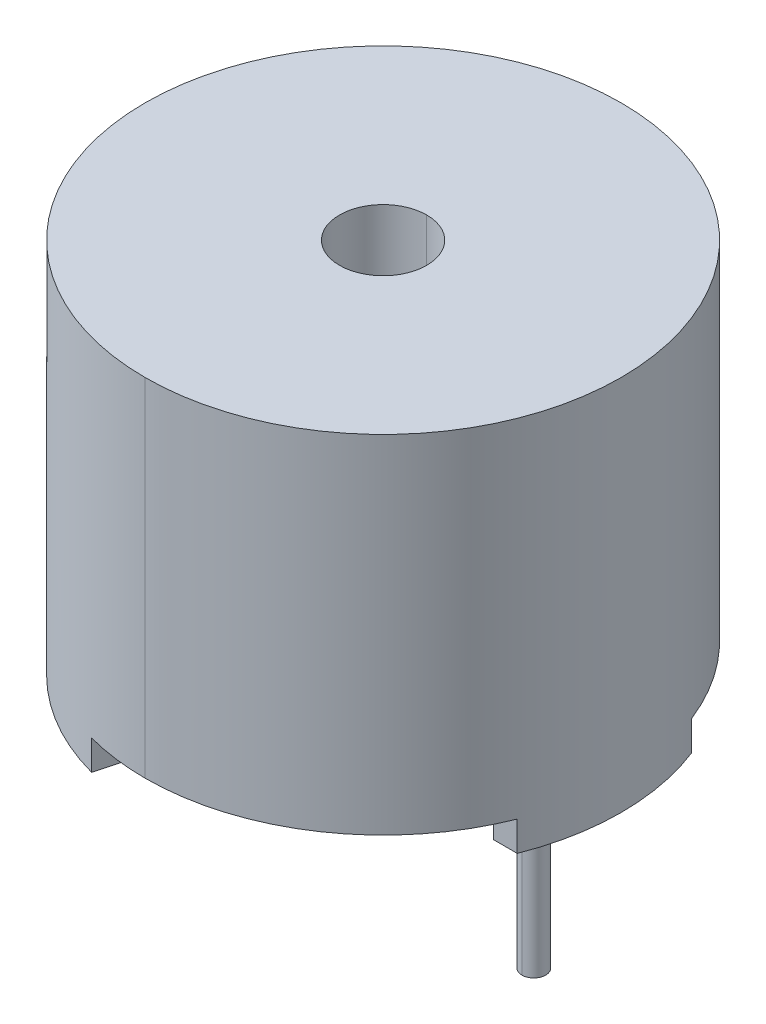
ISO-10303-21;
HEADER;
FILE_DESCRIPTION(('STEP AP214'),'2;1');
FILE_NAME('part.step','',(''),(''),'','','');
FILE_SCHEMA(('AUTOMOTIVE_DESIGN { 1 0 10303 214 1 1 1 1 }'));
ENDSEC;
DATA;
#1=APPLICATION_CONTEXT('core data for automotive mechanical design processes');
#2=APPLICATION_PROTOCOL_DEFINITION('international standard','automotive_design',2000,#1);
#3=PRODUCT_CONTEXT('',#1,'mechanical');
#4=PRODUCT('Part','Part','',(#3));
#5=PRODUCT_RELATED_PRODUCT_CATEGORY('part','',(#4));
#6=PRODUCT_DEFINITION_FORMATION('','',#4);
#7=PRODUCT_DEFINITION_CONTEXT('part definition',#1,'design');
#8=PRODUCT_DEFINITION('design','',#6,#7);
#9=PRODUCT_DEFINITION_SHAPE('','',#8);
#10=(LENGTH_UNIT() NAMED_UNIT(*) SI_UNIT(.MILLI.,.METRE.));
#11=(NAMED_UNIT(*) PLANE_ANGLE_UNIT() SI_UNIT($,.RADIAN.));
#12=(NAMED_UNIT(*) SI_UNIT($,.STERADIAN.) SOLID_ANGLE_UNIT());
#13=UNCERTAINTY_MEASURE_WITH_UNIT(LENGTH_MEASURE(1.E-05),#10,'distance_accuracy_value','');
#14=(GEOMETRIC_REPRESENTATION_CONTEXT(3) GLOBAL_UNCERTAINTY_ASSIGNED_CONTEXT((#13)) GLOBAL_UNIT_ASSIGNED_CONTEXT((#10,
#11,#12)) REPRESENTATION_CONTEXT('',''));
#15=CARTESIAN_POINT('',(0.,0.,0.));
#16=DIRECTION('',(0.,0.,1.));
#17=DIRECTION('',(1.,0.,0.));
#18=AXIS2_PLACEMENT_3D('',#15,#16,#17);
#19=CARTESIAN_POINT('',(-3.8,500000.,0.));
#20=DIRECTION('',(0.,-1.,0.));
#21=DIRECTION('',(0.,0.,-1.));
#22=AXIS2_PLACEMENT_3D('',#19,#20,#21);
#23=CYLINDRICAL_SURFACE('',#22,0.3);
#24=CARTESIAN_POINT('',(-3.8,0.749999999982265,0.));
#25=DIRECTION('',(0.,-1.,0.));
#26=DIRECTION('',(0.,0.,-1.));
#27=AXIS2_PLACEMENT_3D('',#24,#25,#26);
#28=CIRCLE('',#27,0.3);
#29=CARTESIAN_POINT('',(-3.8,0.749999999982265,-0.300000000000001));
#30=VERTEX_POINT('',#29);
#31=CARTESIAN_POINT('',(-3.8,0.749999999982265,0.299999999999999));
#32=VERTEX_POINT('',#31);
#33=EDGE_CURVE('E296',#30,#32,#28,.T.);
#34=ORIENTED_EDGE('',*,*,#33,.T.);
#35=DIRECTION('',(0.,-1.,0.));
#36=VECTOR('',#35,1.);
#37=CARTESIAN_POINT('',(-3.8,500000.,0.299999999999999));
#38=LINE('',#37,#36);
#39=CARTESIAN_POINT('',(-3.8,-3.5,0.299999999999999));
#40=VERTEX_POINT('',#39);
#41=EDGE_CURVE('E288',#32,#40,#38,.T.);
#42=ORIENTED_EDGE('',*,*,#41,.T.);
#43=CARTESIAN_POINT('',(-3.8,-3.5,0.));
#44=DIRECTION('',(0.,-1.,0.));
#45=DIRECTION('',(0.,0.,1.));
#46=AXIS2_PLACEMENT_3D('',#43,#44,#45);
#47=CIRCLE('',#46,0.3);
#48=CARTESIAN_POINT('',(-3.8,-3.5,-0.300000000000001));
#49=VERTEX_POINT('',#48);
#50=EDGE_CURVE('E179',#49,#40,#47,.T.);
#51=ORIENTED_EDGE('',*,*,#50,.F.);
#52=DIRECTION('',(0.,-1.,0.));
#53=VECTOR('',#52,1.);
#54=CARTESIAN_POINT('',(-3.8,500000.,-0.300000000000001));
#55=LINE('',#54,#53);
#56=EDGE_CURVE('E301',#30,#49,#55,.T.);
#57=ORIENTED_EDGE('',*,*,#56,.F.);
#58=EDGE_LOOP('',(#34,#42,#51,#57));
#59=FACE_BOUND('',#58,.T.);
#60=ADVANCED_FACE('F36',(#59),#23,.T.);
#61=CARTESIAN_POINT('',(3.8,500000.,0.));
#62=DIRECTION('',(0.,-1.,0.));
#63=DIRECTION('',(0.,0.,-1.));
#64=AXIS2_PLACEMENT_3D('',#61,#62,#63);
#65=CYLINDRICAL_SURFACE('',#64,0.3);
#66=CARTESIAN_POINT('',(3.8,0.749999999982265,0.));
#67=DIRECTION('',(0.,-1.,0.));
#68=DIRECTION('',(0.,0.,-1.));
#69=AXIS2_PLACEMENT_3D('',#66,#67,#68);
#70=CIRCLE('',#69,0.3);
#71=CARTESIAN_POINT('',(3.8,0.749999999982265,-0.3));
#72=VERTEX_POINT('',#71);
#73=CARTESIAN_POINT('',(3.8,0.749999999982265,0.3));
#74=VERTEX_POINT('',#73);
#75=EDGE_CURVE('E295',#72,#74,#70,.T.);
#76=ORIENTED_EDGE('',*,*,#75,.T.);
#77=DIRECTION('',(0.,-1.,0.));
#78=VECTOR('',#77,1.);
#79=CARTESIAN_POINT('',(3.8,500000.,0.3));
#80=LINE('',#79,#78);
#81=CARTESIAN_POINT('',(3.8,-4.5,0.3));
#82=VERTEX_POINT('',#81);
#83=EDGE_CURVE('E450',#74,#82,#80,.T.);
#84=ORIENTED_EDGE('',*,*,#83,.T.);
#85=CARTESIAN_POINT('',(3.8,-4.5,0.));
#86=DIRECTION('',(0.,-1.,0.));
#87=DIRECTION('',(0.,0.,-1.));
#88=AXIS2_PLACEMENT_3D('',#85,#86,#87);
#89=CIRCLE('',#88,0.3);
#90=CARTESIAN_POINT('',(3.8,-4.5,-0.3));
#91=VERTEX_POINT('',#90);
#92=EDGE_CURVE('E175',#91,#82,#89,.T.);
#93=ORIENTED_EDGE('',*,*,#92,.F.);
#94=DIRECTION('',(0.,-1.,0.));
#95=VECTOR('',#94,1.);
#96=CARTESIAN_POINT('',(3.8,500000.,-0.3));
#97=LINE('',#96,#95);
#98=EDGE_CURVE('E310',#72,#91,#97,.T.);
#99=ORIENTED_EDGE('',*,*,#98,.F.);
#100=EDGE_LOOP('',(#76,#84,#93,#99));
#101=FACE_BOUND('',#100,.T.);
#102=ADVANCED_FACE('F203',(#101),#65,.T.);
#103=CARTESIAN_POINT('',(0.,9.5,0.));
#104=DIRECTION('',(0.,-1.,0.));
#105=DIRECTION('',(0.,0.,-1.));
#106=AXIS2_PLACEMENT_3D('',#103,#104,#105);
#107=CYLINDRICAL_SURFACE('',#106,6.);
#108=CARTESIAN_POINT('',(0.,9.5,0.));
#109=DIRECTION('',(0.,1.,0.));
#110=DIRECTION('',(0.,0.,1.));
#111=AXIS2_PLACEMENT_3D('',#108,#109,#110);
#112=CIRCLE('',#111,6.);
#113=CARTESIAN_POINT('',(0.,9.5,6.));
#114=VERTEX_POINT('',#113);
#115=CARTESIAN_POINT('',(0.,9.5,-6.));
#116=VERTEX_POINT('',#115);
#117=EDGE_CURVE('E346',#114,#116,#112,.T.);
#118=ORIENTED_EDGE('',*,*,#117,.F.);
#119=DIRECTION('',(0.,-1.,0.));
#120=VECTOR('',#119,1.);
#121=CARTESIAN_POINT('',(0.,9.5,6.));
#122=LINE('',#121,#120);
#123=CARTESIAN_POINT('',(0.,0.750000000000001,6.));
#124=VERTEX_POINT('',#123);
#125=EDGE_CURVE('E377',#114,#124,#122,.T.);
#126=ORIENTED_EDGE('',*,*,#125,.T.);
#127=CARTESIAN_POINT('',(0.,0.750000000000001,0.));
#128=DIRECTION('',(0.,-1.,0.));
#129=DIRECTION('',(0.,0.,-1.));
#130=AXIS2_PLACEMENT_3D('',#127,#128,#129);
#131=CIRCLE('',#130,6.);
#132=CARTESIAN_POINT('',(5.58211429478115,0.75,2.2));
#133=VERTEX_POINT('',#132);
#134=EDGE_CURVE('E345',#133,#124,#131,.T.);
#135=ORIENTED_EDGE('',*,*,#134,.F.);
#136=DIRECTION('',(0.,-1.,0.));
#137=VECTOR('',#136,1.);
#138=CARTESIAN_POINT('',(5.58211429478115,0.75,2.2));
#139=LINE('',#138,#137);
#140=CARTESIAN_POINT('',(5.58211429478115,0.,2.2));
#141=VERTEX_POINT('',#140);
#142=EDGE_CURVE('E142',#133,#141,#139,.T.);
#143=ORIENTED_EDGE('',*,*,#142,.T.);
#144=CARTESIAN_POINT('',(0.,0.,0.));
#145=DIRECTION('',(0.,1.,0.));
#146=DIRECTION('',(0.,0.,1.));
#147=AXIS2_PLACEMENT_3D('',#144,#145,#146);
#148=CIRCLE('',#147,6.);
#149=CARTESIAN_POINT('',(5.58211429478115,0.,-2.2));
#150=VERTEX_POINT('',#149);
#151=EDGE_CURVE('E380',#141,#150,#148,.T.);
#152=ORIENTED_EDGE('',*,*,#151,.T.);
#153=DIRECTION('',(0.,-1.,0.));
#154=VECTOR('',#153,1.);
#155=CARTESIAN_POINT('',(5.58211429478115,0.75,-2.2));
#156=LINE('',#155,#154);
#157=CARTESIAN_POINT('',(5.58211429478115,0.75,-2.2));
#158=VERTEX_POINT('',#157);
#159=EDGE_CURVE('E149',#158,#150,#156,.T.);
#160=ORIENTED_EDGE('',*,*,#159,.F.);
#161=CARTESIAN_POINT('',(0.,0.750000000000001,0.));
#162=DIRECTION('',(0.,-1.,0.));
#163=DIRECTION('',(0.,0.,-1.));
#164=AXIS2_PLACEMENT_3D('',#161,#162,#163);
#165=CIRCLE('',#164,6.);
#166=CARTESIAN_POINT('',(0.,0.750000000000001,-6.));
#167=VERTEX_POINT('',#166);
#168=EDGE_CURVE('E132',#167,#158,#165,.T.);
#169=ORIENTED_EDGE('',*,*,#168,.F.);
#170=DIRECTION('',(0.,-1.,0.));
#171=VECTOR('',#170,1.);
#172=CARTESIAN_POINT('',(0.,9.5,-6.));
#173=LINE('',#172,#171);
#174=EDGE_CURVE('E334',#116,#167,#173,.T.);
#175=ORIENTED_EDGE('',*,*,#174,.F.);
#176=EDGE_LOOP('',(#118,#126,#135,#143,#152,#160,#169,#175));
#177=FACE_BOUND('',#176,.T.);
#178=ADVANCED_FACE('F209',(#177),#107,.T.);
#179=CARTESIAN_POINT('',(0.,0.,0.));
#180=DIRECTION('',(0.,1.,0.));
#181=DIRECTION('',(0.,0.,1.));
#182=AXIS2_PLACEMENT_3D('',#179,#180,#181);
#183=PLANE('',#182);
#184=DIRECTION('',(-1.,0.,0.));
#185=VECTOR('',#184,1.);
#186=CARTESIAN_POINT('',(5.58211429478115,0.,2.2));
#187=LINE('',#186,#185);
#188=CARTESIAN_POINT('',(4.98211429478115,0.,2.2));
#189=VERTEX_POINT('',#188);
#190=EDGE_CURVE('E383',#141,#189,#187,.T.);
#191=ORIENTED_EDGE('',*,*,#190,.T.);
#192=CARTESIAN_POINT('',(0.,0.,0.));
#193=DIRECTION('',(0.,1.,0.));
#194=DIRECTION('',(0.,0.,1.));
#195=AXIS2_PLACEMENT_3D('',#192,#193,#194);
#196=CIRCLE('',#195,5.44623382221721);
#197=CARTESIAN_POINT('',(4.98211429478115,0.,-2.2));
#198=VERTEX_POINT('',#197);
#199=EDGE_CURVE('E147',#189,#198,#196,.T.);
#200=ORIENTED_EDGE('',*,*,#199,.T.);
#201=DIRECTION('',(1.,0.,0.));
#202=VECTOR('',#201,1.);
#203=CARTESIAN_POINT('',(5.58211429478115,0.,-2.2));
#204=LINE('',#203,#202);
#205=EDGE_CURVE('E392',#198,#150,#204,.T.);
#206=ORIENTED_EDGE('',*,*,#205,.T.);
#207=ORIENTED_EDGE('',*,*,#151,.F.);
#208=EDGE_LOOP('',(#191,#200,#206,#207));
#209=FACE_BOUND('',#208,.T.);
#210=ADVANCED_FACE('F216',(#209),#183,.F.);
#211=CARTESIAN_POINT('',(0.,0.,0.));
#212=DIRECTION('',(0.,1.,0.));
#213=DIRECTION('',(0.,0.,1.));
#214=AXIS2_PLACEMENT_3D('',#211,#212,#213);
#215=PLANE('',#214);
#216=DIRECTION('',(-0.258819045102525,0.,0.965925826289067));
#217=VECTOR('',#216,1.);
#218=CARTESIAN_POINT('',(-1.55291427061515,0.,5.7955549577344));
#219=LINE('',#218,#217);
#220=CARTESIAN_POINT('',(-1.39762284355364,0.,5.21599946196096));
#221=VERTEX_POINT('',#220);
#222=CARTESIAN_POINT('',(-1.55291427061515,0.,5.7955549577344));
#223=VERTEX_POINT('',#222);
#224=EDGE_CURVE('E362',#221,#223,#219,.T.);
#225=ORIENTED_EDGE('',*,*,#224,.T.);
#226=CARTESIAN_POINT('',(0.,0.,0.));
#227=DIRECTION('',(0.,1.,0.));
#228=DIRECTION('',(0.,0.,1.));
#229=AXIS2_PLACEMENT_3D('',#226,#227,#228);
#230=CIRCLE('',#229,6.);
#231=CARTESIAN_POINT('',(-4.24264068711928,0.,4.24264068711929));
#232=VERTEX_POINT('',#231);
#233=EDGE_CURVE('E357',#232,#223,#230,.T.);
#234=ORIENTED_EDGE('',*,*,#233,.F.);
#235=DIRECTION('',(0.707106781186547,0.,-0.707106781186548));
#236=VECTOR('',#235,1.);
#237=CARTESIAN_POINT('',(-3.81837661840735,0.,3.81837661840736));
#238=LINE('',#237,#236);
#239=CARTESIAN_POINT('',(-3.81837661840735,0.,3.81837661840736));
#240=VERTEX_POINT('',#239);
#241=EDGE_CURVE('E396',#232,#240,#238,.T.);
#242=ORIENTED_EDGE('',*,*,#241,.T.);
#243=CARTESIAN_POINT('',(0.,0.,0.));
#244=DIRECTION('',(0.,1.,0.));
#245=DIRECTION('',(0.,0.,-1.));
#246=AXIS2_PLACEMENT_3D('',#243,#244,#245);
#247=CIRCLE('',#246,5.4);
#248=EDGE_CURVE('E400',#240,#221,#247,.T.);
#249=ORIENTED_EDGE('',*,*,#248,.T.);
#250=EDGE_LOOP('',(#225,#234,#242,#249));
#251=FACE_BOUND('',#250,.T.);
#252=ADVANCED_FACE('F220',(#251),#215,.F.);
#253=CARTESIAN_POINT('',(0.,0.,0.));
#254=DIRECTION('',(0.,1.,0.));
#255=DIRECTION('',(0.,0.,1.));
#256=AXIS2_PLACEMENT_3D('',#253,#254,#255);
#257=PLANE('',#256);
#258=DIRECTION('',(-0.707106781186546,0.,-0.707106781186549));
#259=VECTOR('',#258,1.);
#260=CARTESIAN_POINT('',(-3.81837661840735,0.,-3.81837661840737));
#261=LINE('',#260,#259);
#262=CARTESIAN_POINT('',(-3.81837661840735,0.,-3.81837661840737));
#263=VERTEX_POINT('',#262);
#264=CARTESIAN_POINT('',(-4.24264068711928,0.,-4.24264068711929));
#265=VERTEX_POINT('',#264);
#266=EDGE_CURVE('E73',#263,#265,#261,.T.);
#267=ORIENTED_EDGE('',*,*,#266,.T.);
#268=CARTESIAN_POINT('',(0.,0.,0.));
#269=DIRECTION('',(0.,1.,0.));
#270=DIRECTION('',(0.,0.,1.));
#271=AXIS2_PLACEMENT_3D('',#268,#269,#270);
#272=CIRCLE('',#271,6.);
#273=CARTESIAN_POINT('',(-1.55291427061515,0.,-5.79555495773441));
#274=VERTEX_POINT('',#273);
#275=EDGE_CURVE('E351',#274,#265,#272,.T.);
#276=ORIENTED_EDGE('',*,*,#275,.F.);
#277=DIRECTION('',(0.258819045102525,0.,0.965925826289067));
#278=VECTOR('',#277,1.);
#279=CARTESIAN_POINT('',(-1.55291427061515,0.,-5.79555495773441));
#280=LINE('',#279,#278);
#281=CARTESIAN_POINT('',(-1.39762284355363,0.,-5.21599946196097));
#282=VERTEX_POINT('',#281);
#283=EDGE_CURVE('E335',#274,#282,#280,.T.);
#284=ORIENTED_EDGE('',*,*,#283,.T.);
#285=CARTESIAN_POINT('',(0.,0.,0.));
#286=DIRECTION('',(0.,1.,0.));
#287=DIRECTION('',(0.,0.,1.));
#288=AXIS2_PLACEMENT_3D('',#285,#286,#287);
#289=CIRCLE('',#288,5.4);
#290=EDGE_CURVE('E333',#282,#263,#289,.T.);
#291=ORIENTED_EDGE('',*,*,#290,.T.);
#292=EDGE_LOOP('',(#267,#276,#284,#291));
#293=FACE_BOUND('',#292,.T.);
#294=ADVANCED_FACE('F224',(#293),#257,.F.);
#295=CARTESIAN_POINT('',(0.,9.5,0.));
#296=DIRECTION('',(0.,-1.,0.));
#297=DIRECTION('',(0.,0.,-1.));
#298=AXIS2_PLACEMENT_3D('',#295,#296,#297);
#299=CYLINDRICAL_SURFACE('',#298,6.);
#300=ORIENTED_EDGE('',*,*,#125,.F.);
#301=CARTESIAN_POINT('',(0.,9.5,0.));
#302=DIRECTION('',(0.,1.,0.));
#303=DIRECTION('',(0.,0.,1.));
#304=AXIS2_PLACEMENT_3D('',#301,#302,#303);
#305=CIRCLE('',#304,6.);
#306=EDGE_CURVE('E342',#116,#114,#305,.T.);
#307=ORIENTED_EDGE('',*,*,#306,.F.);
#308=ORIENTED_EDGE('',*,*,#174,.T.);
#309=CARTESIAN_POINT('',(0.,0.750000000000001,0.));
#310=DIRECTION('',(0.,-1.,0.));
#311=DIRECTION('',(0.,0.,-1.));
#312=AXIS2_PLACEMENT_3D('',#309,#310,#311);
#313=CIRCLE('',#312,6.);
#314=CARTESIAN_POINT('',(-1.55291427061515,0.75,-5.79555495773441));
#315=VERTEX_POINT('',#314);
#316=EDGE_CURVE('E347',#315,#167,#313,.T.);
#317=ORIENTED_EDGE('',*,*,#316,.F.);
#318=DIRECTION('',(0.,-1.,0.));
#319=VECTOR('',#318,1.);
#320=CARTESIAN_POINT('',(-1.55291427061515,0.75,-5.79555495773441));
#321=LINE('',#320,#319);
#322=EDGE_CURVE('E330',#315,#274,#321,.T.);
#323=ORIENTED_EDGE('',*,*,#322,.T.);
#324=ORIENTED_EDGE('',*,*,#275,.T.);
#325=DIRECTION('',(0.,-1.,0.));
#326=VECTOR('',#325,1.);
#327=CARTESIAN_POINT('',(-4.24264068711928,0.75,-4.24264068711929));
#328=LINE('',#327,#326);
#329=CARTESIAN_POINT('',(-4.24264068711928,0.75,-4.24264068711929));
#330=VERTEX_POINT('',#329);
#331=EDGE_CURVE('E321',#330,#265,#328,.T.);
#332=ORIENTED_EDGE('',*,*,#331,.F.);
#333=CARTESIAN_POINT('',(0.,0.750000000000001,0.));
#334=DIRECTION('',(0.,-1.,0.));
#335=DIRECTION('',(0.,0.,-1.));
#336=AXIS2_PLACEMENT_3D('',#333,#334,#335);
#337=CIRCLE('',#336,6.);
#338=CARTESIAN_POINT('',(-4.24264068711928,0.75,4.24264068711929));
#339=VERTEX_POINT('',#338);
#340=EDGE_CURVE('E349',#339,#330,#337,.T.);
#341=ORIENTED_EDGE('',*,*,#340,.F.);
#342=DIRECTION('',(0.,-1.,0.));
#343=VECTOR('',#342,1.);
#344=CARTESIAN_POINT('',(-4.24264068711928,0.75,4.24264068711929));
#345=LINE('',#344,#343);
#346=EDGE_CURVE('E355',#339,#232,#345,.T.);
#347=ORIENTED_EDGE('',*,*,#346,.T.);
#348=ORIENTED_EDGE('',*,*,#233,.T.);
#349=DIRECTION('',(0.,-1.,0.));
#350=VECTOR('',#349,1.);
#351=CARTESIAN_POINT('',(-1.55291427061515,0.75,5.7955549577344));
#352=LINE('',#351,#350);
#353=CARTESIAN_POINT('',(-1.55291427061515,0.75,5.7955549577344));
#354=VERTEX_POINT('',#353);
#355=EDGE_CURVE('E314',#354,#223,#352,.T.);
#356=ORIENTED_EDGE('',*,*,#355,.F.);
#357=CARTESIAN_POINT('',(0.,0.750000000000001,0.));
#358=DIRECTION('',(0.,-1.,0.));
#359=DIRECTION('',(0.,0.,-1.));
#360=AXIS2_PLACEMENT_3D('',#357,#358,#359);
#361=CIRCLE('',#360,6.);
#362=EDGE_CURVE('E306',#124,#354,#361,.T.);
#363=ORIENTED_EDGE('',*,*,#362,.F.);
#364=EDGE_LOOP('',(#300,#307,#308,#317,#323,#324,#332,#341,#347,#348,#356,#363));
#365=FACE_BOUND('',#364,.T.);
#366=ADVANCED_FACE('F228',(#365),#299,.T.);
#367=CARTESIAN_POINT('',(0.,9.5,0.));
#368=DIRECTION('',(0.,1.,0.));
#369=DIRECTION('',(0.,0.,1.));
#370=AXIS2_PLACEMENT_3D('',#367,#368,#369);
#371=PLANE('',#370);
#372=ORIENTED_EDGE('',*,*,#306,.T.);
#373=ORIENTED_EDGE('',*,*,#117,.T.);
#374=EDGE_LOOP('',(#372,#373));
#375=FACE_BOUND('',#374,.T.);
#376=CARTESIAN_POINT('',(0.,9.5,0.));
#377=DIRECTION('',(0.,1.,0.));
#378=DIRECTION('',(0.,0.,1.));
#379=AXIS2_PLACEMENT_3D('',#376,#377,#378);
#380=CIRCLE('',#379,1.1);
#381=CARTESIAN_POINT('',(0.,9.5,-1.1));
#382=VERTEX_POINT('',#381);
#383=CARTESIAN_POINT('',(0.,9.5,1.1));
#384=VERTEX_POINT('',#383);
#385=EDGE_CURVE('E65',#382,#384,#380,.T.);
#386=ORIENTED_EDGE('',*,*,#385,.F.);
#387=CARTESIAN_POINT('',(0.,9.5,0.));
#388=DIRECTION('',(0.,1.,0.));
#389=DIRECTION('',(0.,0.,1.));
#390=AXIS2_PLACEMENT_3D('',#387,#388,#389);
#391=CIRCLE('',#390,1.1);
#392=EDGE_CURVE('E11',#384,#382,#391,.T.);
#393=ORIENTED_EDGE('',*,*,#392,.F.);
#394=EDGE_LOOP('',(#386,#393));
#395=FACE_BOUND('',#394,.T.);
#396=ADVANCED_FACE('F232',(#375,#395),#371,.T.);
#397=CARTESIAN_POINT('',(0.274198215040875,0.75,0.));
#398=DIRECTION('',(0.,-1.,0.));
#399=DIRECTION('',(0.,0.,-1.));
#400=AXIS2_PLACEMENT_3D('',#397,#398,#399);
#401=PLANE('',#400);
#402=ORIENTED_EDGE('',*,*,#33,.F.);
#403=CARTESIAN_POINT('',(-3.8,0.749999999982265,0.));
#404=DIRECTION('',(0.,-1.,0.));
#405=DIRECTION('',(0.,0.,-1.));
#406=AXIS2_PLACEMENT_3D('',#403,#404,#405);
#407=CIRCLE('',#406,0.3);
#408=EDGE_CURVE('E174',#32,#30,#407,.T.);
#409=ORIENTED_EDGE('',*,*,#408,.F.);
#410=EDGE_LOOP('',(#402,#409));
#411=FACE_BOUND('',#410,.T.);
#412=ORIENTED_EDGE('',*,*,#75,.F.);
#413=CARTESIAN_POINT('',(3.8,0.749999999982265,0.));
#414=DIRECTION('',(0.,-1.,0.));
#415=DIRECTION('',(0.,0.,-1.));
#416=AXIS2_PLACEMENT_3D('',#413,#414,#415);
#417=CIRCLE('',#416,0.3);
#418=EDGE_CURVE('E170',#74,#72,#417,.T.);
#419=ORIENTED_EDGE('',*,*,#418,.F.);
#420=EDGE_LOOP('',(#412,#419));
#421=FACE_BOUND('',#420,.T.);
#422=ORIENTED_EDGE('',*,*,#134,.T.);
#423=ORIENTED_EDGE('',*,*,#362,.T.);
#424=DIRECTION('',(-0.258819045102525,0.,0.965925826289067));
#425=VECTOR('',#424,1.);
#426=CARTESIAN_POINT('',(-1.55291427061515,0.75,5.7955549577344));
#427=LINE('',#426,#425);
#428=CARTESIAN_POINT('',(-1.39762284355364,0.75,5.21599946196096));
#429=VERTEX_POINT('',#428);
#430=EDGE_CURVE('E311',#429,#354,#427,.T.);
#431=ORIENTED_EDGE('',*,*,#430,.F.);
#432=CARTESIAN_POINT('',(0.,0.75,0.));
#433=DIRECTION('',(0.,1.,0.));
#434=DIRECTION('',(0.,0.,-1.));
#435=AXIS2_PLACEMENT_3D('',#432,#433,#434);
#436=CIRCLE('',#435,5.4);
#437=CARTESIAN_POINT('',(-3.81837661840735,0.75,3.81837661840736));
#438=VERTEX_POINT('',#437);
#439=EDGE_CURVE('E157',#438,#429,#436,.T.);
#440=ORIENTED_EDGE('',*,*,#439,.F.);
#441=DIRECTION('',(0.707106781186547,0.,-0.707106781186548));
#442=VECTOR('',#441,1.);
#443=CARTESIAN_POINT('',(-3.81837661840735,0.75,3.81837661840736));
#444=LINE('',#443,#442);
#445=EDGE_CURVE('E156',#339,#438,#444,.T.);
#446=ORIENTED_EDGE('',*,*,#445,.F.);
#447=ORIENTED_EDGE('',*,*,#340,.T.);
#448=DIRECTION('',(-0.707106781186546,0.,-0.707106781186549));
#449=VECTOR('',#448,1.);
#450=CARTESIAN_POINT('',(-3.81837661840735,0.75,-3.81837661840737));
#451=LINE('',#450,#449);
#452=CARTESIAN_POINT('',(-3.81837661840735,0.75,-3.81837661840737));
#453=VERTEX_POINT('',#452);
#454=EDGE_CURVE('E161',#453,#330,#451,.T.);
#455=ORIENTED_EDGE('',*,*,#454,.F.);
#456=CARTESIAN_POINT('',(0.,0.75,0.));
#457=DIRECTION('',(0.,1.,0.));
#458=DIRECTION('',(0.,0.,1.));
#459=AXIS2_PLACEMENT_3D('',#456,#457,#458);
#460=CIRCLE('',#459,5.4);
#461=CARTESIAN_POINT('',(-1.39762284355363,0.75,-5.21599946196097));
#462=VERTEX_POINT('',#461);
#463=EDGE_CURVE('E166',#462,#453,#460,.T.);
#464=ORIENTED_EDGE('',*,*,#463,.F.);
#465=DIRECTION('',(0.258819045102525,0.,0.965925826289067));
#466=VECTOR('',#465,1.);
#467=CARTESIAN_POINT('',(-1.55291427061515,0.75,-5.79555495773441));
#468=LINE('',#467,#466);
#469=EDGE_CURVE('E165',#315,#462,#468,.T.);
#470=ORIENTED_EDGE('',*,*,#469,.F.);
#471=ORIENTED_EDGE('',*,*,#316,.T.);
#472=ORIENTED_EDGE('',*,*,#168,.T.);
#473=DIRECTION('',(1.,0.,0.));
#474=VECTOR('',#473,1.);
#475=CARTESIAN_POINT('',(5.58211429478115,0.75,-2.2));
#476=LINE('',#475,#474);
#477=CARTESIAN_POINT('',(4.98211429478115,0.75,-2.2));
#478=VERTEX_POINT('',#477);
#479=EDGE_CURVE('E118',#478,#158,#476,.T.);
#480=ORIENTED_EDGE('',*,*,#479,.F.);
#481=CARTESIAN_POINT('',(0.,0.75,0.));
#482=DIRECTION('',(0.,1.,0.));
#483=DIRECTION('',(0.,0.,1.));
#484=AXIS2_PLACEMENT_3D('',#481,#482,#483);
#485=CIRCLE('',#484,5.44623382221721);
#486=CARTESIAN_POINT('',(4.98211429478115,0.75,2.2));
#487=VERTEX_POINT('',#486);
#488=EDGE_CURVE('E121',#487,#478,#485,.T.);
#489=ORIENTED_EDGE('',*,*,#488,.F.);
#490=DIRECTION('',(-1.,0.,0.));
#491=VECTOR('',#490,1.);
#492=CARTESIAN_POINT('',(5.58211429478115,0.75,2.2));
#493=LINE('',#492,#491);
#494=EDGE_CURVE('E126',#133,#487,#493,.T.);
#495=ORIENTED_EDGE('',*,*,#494,.F.);
#496=EDGE_LOOP('',(#422,#423,#431,#440,#446,#447,#455,#464,#470,#471,#472,#480,#489,#495));
#497=FACE_BOUND('',#496,.T.);
#498=ADVANCED_FACE('F124',(#411,#421,#497),#401,.T.);
#499=CARTESIAN_POINT('',(0.,0.75,0.));
#500=DIRECTION('',(0.,-1.,0.));
#501=DIRECTION('',(0.,0.,-1.));
#502=AXIS2_PLACEMENT_3D('',#499,#500,#501);
#503=CYLINDRICAL_SURFACE('',#502,5.44623382221721);
#504=ORIENTED_EDGE('',*,*,#199,.F.);
#505=DIRECTION('',(0.,-1.,0.));
#506=VECTOR('',#505,1.);
#507=CARTESIAN_POINT('',(4.98211429478115,0.75,2.2));
#508=LINE('',#507,#506);
#509=EDGE_CURVE('E140',#487,#189,#508,.T.);
#510=ORIENTED_EDGE('',*,*,#509,.F.);
#511=ORIENTED_EDGE('',*,*,#488,.T.);
#512=DIRECTION('',(0.,-1.,0.));
#513=VECTOR('',#512,1.);
#514=CARTESIAN_POINT('',(4.98211429478115,0.75,-2.2));
#515=LINE('',#514,#513);
#516=EDGE_CURVE('E131',#478,#198,#515,.T.);
#517=ORIENTED_EDGE('',*,*,#516,.T.);
#518=EDGE_LOOP('',(#504,#510,#511,#517));
#519=FACE_BOUND('',#518,.T.);
#520=ADVANCED_FACE('F145',(#519),#503,.F.);
#521=CARTESIAN_POINT('',(5.58211429478115,0.75,2.2));
#522=DIRECTION('',(0.,0.,1.));
#523=DIRECTION('',(1.,0.,0.));
#524=AXIS2_PLACEMENT_3D('',#521,#522,#523);
#525=PLANE('',#524);
#526=ORIENTED_EDGE('',*,*,#190,.F.);
#527=ORIENTED_EDGE('',*,*,#142,.F.);
#528=ORIENTED_EDGE('',*,*,#494,.T.);
#529=ORIENTED_EDGE('',*,*,#509,.T.);
#530=EDGE_LOOP('',(#526,#527,#528,#529));
#531=FACE_BOUND('',#530,.T.);
#532=ADVANCED_FACE('F138',(#531),#525,.T.);
#533=CARTESIAN_POINT('',(5.58211429478115,0.75,-2.2));
#534=DIRECTION('',(0.,0.,-1.));
#535=DIRECTION('',(-1.,0.,0.));
#536=AXIS2_PLACEMENT_3D('',#533,#534,#535);
#537=PLANE('',#536);
#538=ORIENTED_EDGE('',*,*,#205,.F.);
#539=ORIENTED_EDGE('',*,*,#516,.F.);
#540=ORIENTED_EDGE('',*,*,#479,.T.);
#541=ORIENTED_EDGE('',*,*,#159,.T.);
#542=EDGE_LOOP('',(#538,#539,#540,#541));
#543=FACE_BOUND('',#542,.T.);
#544=ADVANCED_FACE('F244',(#543),#537,.T.);
#545=CARTESIAN_POINT('',(-1.55291427061515,0.75,5.79555495773441));
#546=DIRECTION('',(0.965925826289067,0.,0.258819045102525));
#547=DIRECTION('',(0.258819045102525,0.,-0.965925826289067));
#548=AXIS2_PLACEMENT_3D('',#545,#546,#547);
#549=PLANE('',#548);
#550=ORIENTED_EDGE('',*,*,#224,.F.);
#551=DIRECTION('',(0.,-1.,0.));
#552=VECTOR('',#551,1.);
#553=CARTESIAN_POINT('',(-1.39762284355364,0.75,5.21599946196096));
#554=LINE('',#553,#552);
#555=EDGE_CURVE('E153',#429,#221,#554,.T.);
#556=ORIENTED_EDGE('',*,*,#555,.F.);
#557=ORIENTED_EDGE('',*,*,#430,.T.);
#558=ORIENTED_EDGE('',*,*,#355,.T.);
#559=EDGE_LOOP('',(#550,#556,#557,#558));
#560=FACE_BOUND('',#559,.T.);
#561=ADVANCED_FACE('F247',(#560),#549,.T.);
#562=CARTESIAN_POINT('',(0.,0.75,0.));
#563=DIRECTION('',(0.,-1.,0.));
#564=DIRECTION('',(0.,0.,-1.));
#565=AXIS2_PLACEMENT_3D('',#562,#563,#564);
#566=CYLINDRICAL_SURFACE('',#565,5.4);
#567=ORIENTED_EDGE('',*,*,#248,.F.);
#568=DIRECTION('',(0.,-1.,0.));
#569=VECTOR('',#568,1.);
#570=CARTESIAN_POINT('',(-3.81837661840735,0.75,3.81837661840736));
#571=LINE('',#570,#569);
#572=EDGE_CURVE('E158',#438,#240,#571,.T.);
#573=ORIENTED_EDGE('',*,*,#572,.F.);
#574=ORIENTED_EDGE('',*,*,#439,.T.);
#575=ORIENTED_EDGE('',*,*,#555,.T.);
#576=EDGE_LOOP('',(#567,#573,#574,#575));
#577=FACE_BOUND('',#576,.T.);
#578=ADVANCED_FACE('F251',(#577),#566,.F.);
#579=CARTESIAN_POINT('',(-3.81837661840735,0.75,3.81837661840736));
#580=DIRECTION('',(-0.707106781186548,0.,-0.707106781186547));
#581=DIRECTION('',(-0.707106781186547,0.,0.707106781186548));
#582=AXIS2_PLACEMENT_3D('',#579,#580,#581);
#583=PLANE('',#582);
#584=ORIENTED_EDGE('',*,*,#241,.F.);
#585=ORIENTED_EDGE('',*,*,#346,.F.);
#586=ORIENTED_EDGE('',*,*,#445,.T.);
#587=ORIENTED_EDGE('',*,*,#572,.T.);
#588=EDGE_LOOP('',(#584,#585,#586,#587));
#589=FACE_BOUND('',#588,.T.);
#590=ADVANCED_FACE('F255',(#589),#583,.T.);
#591=CARTESIAN_POINT('',(-3.81837661840735,0.75,-3.81837661840737));
#592=DIRECTION('',(-0.707106781186549,0.,0.707106781186546));
#593=DIRECTION('',(0.707106781186546,0.,0.707106781186549));
#594=AXIS2_PLACEMENT_3D('',#591,#592,#593);
#595=PLANE('',#594);
#596=ORIENTED_EDGE('',*,*,#266,.F.);
#597=DIRECTION('',(0.,-1.,0.));
#598=VECTOR('',#597,1.);
#599=CARTESIAN_POINT('',(-3.81837661840735,0.75,-3.81837661840737));
#600=LINE('',#599,#598);
#601=EDGE_CURVE('E162',#453,#263,#600,.T.);
#602=ORIENTED_EDGE('',*,*,#601,.F.);
#603=ORIENTED_EDGE('',*,*,#454,.T.);
#604=ORIENTED_EDGE('',*,*,#331,.T.);
#605=EDGE_LOOP('',(#596,#602,#603,#604));
#606=FACE_BOUND('',#605,.T.);
#607=ADVANCED_FACE('F259',(#606),#595,.T.);
#608=CARTESIAN_POINT('',(0.,0.75,0.));
#609=DIRECTION('',(0.,-1.,0.));
#610=DIRECTION('',(0.,0.,-1.));
#611=AXIS2_PLACEMENT_3D('',#608,#609,#610);
#612=CYLINDRICAL_SURFACE('',#611,5.4);
#613=ORIENTED_EDGE('',*,*,#290,.F.);
#614=DIRECTION('',(0.,-1.,0.));
#615=VECTOR('',#614,1.);
#616=CARTESIAN_POINT('',(-1.39762284355363,0.75,-5.21599946196097));
#617=LINE('',#616,#615);
#618=EDGE_CURVE('E167',#462,#282,#617,.T.);
#619=ORIENTED_EDGE('',*,*,#618,.F.);
#620=ORIENTED_EDGE('',*,*,#463,.T.);
#621=ORIENTED_EDGE('',*,*,#601,.T.);
#622=EDGE_LOOP('',(#613,#619,#620,#621));
#623=FACE_BOUND('',#622,.T.);
#624=ADVANCED_FACE('F263',(#623),#612,.F.);
#625=CARTESIAN_POINT('',(-1.55291427061515,0.75,-5.79555495773441));
#626=DIRECTION('',(0.965925826289067,0.,-0.258819045102525));
#627=DIRECTION('',(-0.258819045102525,0.,-0.965925826289067));
#628=AXIS2_PLACEMENT_3D('',#625,#626,#627);
#629=PLANE('',#628);
#630=ORIENTED_EDGE('',*,*,#283,.F.);
#631=ORIENTED_EDGE('',*,*,#322,.F.);
#632=ORIENTED_EDGE('',*,*,#469,.T.);
#633=ORIENTED_EDGE('',*,*,#618,.T.);
#634=EDGE_LOOP('',(#630,#631,#632,#633));
#635=FACE_BOUND('',#634,.T.);
#636=ADVANCED_FACE('F266',(#635),#629,.T.);
#637=CARTESIAN_POINT('',(3.8,500000.,0.));
#638=DIRECTION('',(0.,-1.,0.));
#639=DIRECTION('',(0.,0.,-1.));
#640=AXIS2_PLACEMENT_3D('',#637,#638,#639);
#641=CYLINDRICAL_SURFACE('',#640,0.3);
#642=ORIENTED_EDGE('',*,*,#83,.F.);
#643=ORIENTED_EDGE('',*,*,#418,.T.);
#644=ORIENTED_EDGE('',*,*,#98,.T.);
#645=CARTESIAN_POINT('',(3.8,-4.5,0.));
#646=DIRECTION('',(0.,-1.,0.));
#647=DIRECTION('',(0.,0.,-1.));
#648=AXIS2_PLACEMENT_3D('',#645,#646,#647);
#649=CIRCLE('',#648,0.3);
#650=EDGE_CURVE('E171',#82,#91,#649,.T.);
#651=ORIENTED_EDGE('',*,*,#650,.F.);
#652=EDGE_LOOP('',(#642,#643,#644,#651));
#653=FACE_BOUND('',#652,.T.);
#654=ADVANCED_FACE('F270',(#653),#641,.T.);
#655=CARTESIAN_POINT('',(3.8,-4.5,0.));
#656=DIRECTION('',(0.,-1.,0.));
#657=DIRECTION('',(0.,0.,-1.));
#658=AXIS2_PLACEMENT_3D('',#655,#656,#657);
#659=PLANE('',#658);
#660=ORIENTED_EDGE('',*,*,#92,.T.);
#661=ORIENTED_EDGE('',*,*,#650,.T.);
#662=EDGE_LOOP('',(#660,#661));
#663=FACE_BOUND('',#662,.T.);
#664=ADVANCED_FACE('F274',(#663),#659,.T.);
#665=CARTESIAN_POINT('',(-3.8,500000.,0.));
#666=DIRECTION('',(0.,-1.,0.));
#667=DIRECTION('',(0.,0.,-1.));
#668=AXIS2_PLACEMENT_3D('',#665,#666,#667);
#669=CYLINDRICAL_SURFACE('',#668,0.3);
#670=ORIENTED_EDGE('',*,*,#41,.F.);
#671=ORIENTED_EDGE('',*,*,#408,.T.);
#672=ORIENTED_EDGE('',*,*,#56,.T.);
#673=CARTESIAN_POINT('',(-3.8,-3.5,0.));
#674=DIRECTION('',(0.,-1.,0.));
#675=DIRECTION('',(0.,0.,1.));
#676=AXIS2_PLACEMENT_3D('',#673,#674,#675);
#677=CIRCLE('',#676,0.3);
#678=EDGE_CURVE('E176',#40,#49,#677,.T.);
#679=ORIENTED_EDGE('',*,*,#678,.F.);
#680=EDGE_LOOP('',(#670,#671,#672,#679));
#681=FACE_BOUND('',#680,.T.);
#682=ADVANCED_FACE('F199',(#681),#669,.T.);
#683=CARTESIAN_POINT('',(0.,-3.5,0.));
#684=DIRECTION('',(0.,1.,0.));
#685=DIRECTION('',(0.,0.,1.));
#686=AXIS2_PLACEMENT_3D('',#683,#684,#685);
#687=PLANE('',#686);
#688=ORIENTED_EDGE('',*,*,#50,.T.);
#689=ORIENTED_EDGE('',*,*,#678,.T.);
#690=EDGE_LOOP('',(#688,#689));
#691=FACE_BOUND('',#690,.T.);
#692=ADVANCED_FACE('F193',(#691),#687,.F.);
#693=CARTESIAN_POINT('',(0.,6.5,0.));
#694=DIRECTION('',(0.,1.,0.));
#695=DIRECTION('',(0.,0.,1.));
#696=AXIS2_PLACEMENT_3D('',#693,#694,#695);
#697=CYLINDRICAL_SURFACE('',#696,1.1);
#698=CARTESIAN_POINT('',(0.,6.5,0.));
#699=DIRECTION('',(0.,1.,0.));
#700=DIRECTION('',(0.,0.,1.));
#701=AXIS2_PLACEMENT_3D('',#698,#699,#700);
#702=CIRCLE('',#701,1.1);
#703=CARTESIAN_POINT('',(0.,6.5,-1.1));
#704=VERTEX_POINT('',#703);
#705=CARTESIAN_POINT('',(0.,6.5,1.1));
#706=VERTEX_POINT('',#705);
#707=EDGE_CURVE('E180',#704,#706,#702,.T.);
#708=ORIENTED_EDGE('',*,*,#707,.F.);
#709=DIRECTION('',(0.,1.,0.));
#710=VECTOR('',#709,1.);
#711=CARTESIAN_POINT('',(0.,6.5,-1.1));
#712=LINE('',#711,#710);
#713=EDGE_CURVE('E52',#704,#382,#712,.T.);
#714=ORIENTED_EDGE('',*,*,#713,.T.);
#715=ORIENTED_EDGE('',*,*,#385,.T.);
#716=DIRECTION('',(0.,1.,0.));
#717=VECTOR('',#716,1.);
#718=CARTESIAN_POINT('',(0.,6.5,1.1));
#719=LINE('',#718,#717);
#720=EDGE_CURVE('E45',#706,#384,#719,.T.);
#721=ORIENTED_EDGE('',*,*,#720,.F.);
#722=EDGE_LOOP('',(#708,#714,#715,#721));
#723=FACE_BOUND('',#722,.T.);
#724=ADVANCED_FACE('F191',(#723),#697,.F.);
#725=CARTESIAN_POINT('',(0.,6.5,0.));
#726=DIRECTION('',(0.,1.,0.));
#727=DIRECTION('',(0.,0.,1.));
#728=AXIS2_PLACEMENT_3D('',#725,#726,#727);
#729=PLANE('',#728);
#730=CARTESIAN_POINT('',(0.,6.5,0.));
#731=DIRECTION('',(0.,1.,0.));
#732=DIRECTION('',(0.,0.,1.));
#733=AXIS2_PLACEMENT_3D('',#730,#731,#732);
#734=CIRCLE('',#733,1.1);
#735=EDGE_CURVE('E183',#706,#704,#734,.T.);
#736=ORIENTED_EDGE('',*,*,#735,.T.);
#737=ORIENTED_EDGE('',*,*,#707,.T.);
#738=EDGE_LOOP('',(#736,#737));
#739=FACE_BOUND('',#738,.T.);
#740=ADVANCED_FACE('F189',(#739),#729,.T.);
#741=CARTESIAN_POINT('',(0.,6.5,0.));
#742=DIRECTION('',(0.,1.,0.));
#743=DIRECTION('',(0.,0.,1.));
#744=AXIS2_PLACEMENT_3D('',#741,#742,#743);
#745=CYLINDRICAL_SURFACE('',#744,1.1);
#746=ORIENTED_EDGE('',*,*,#713,.F.);
#747=ORIENTED_EDGE('',*,*,#735,.F.);
#748=ORIENTED_EDGE('',*,*,#720,.T.);
#749=ORIENTED_EDGE('',*,*,#392,.T.);
#750=EDGE_LOOP('',(#746,#747,#748,#749));
#751=FACE_BOUND('',#750,.T.);
#752=ADVANCED_FACE('F38',(#751),#745,.F.);
#753=CLOSED_SHELL('',(#60,#102,#178,#210,#252,#294,#366,#396,#498,#520,#532,#544,#561,#578,#590,
#607,#624,#636,#654,#664,#682,#692,#724,#740,#752));
#754=MANIFOLD_SOLID_BREP('B2',#753);
#755=ADVANCED_BREP_SHAPE_REPRESENTATION('',(#18,#754),#14);
#756=SHAPE_DEFINITION_REPRESENTATION(#9,#755);
ENDSEC;
END-ISO-10303-21;
